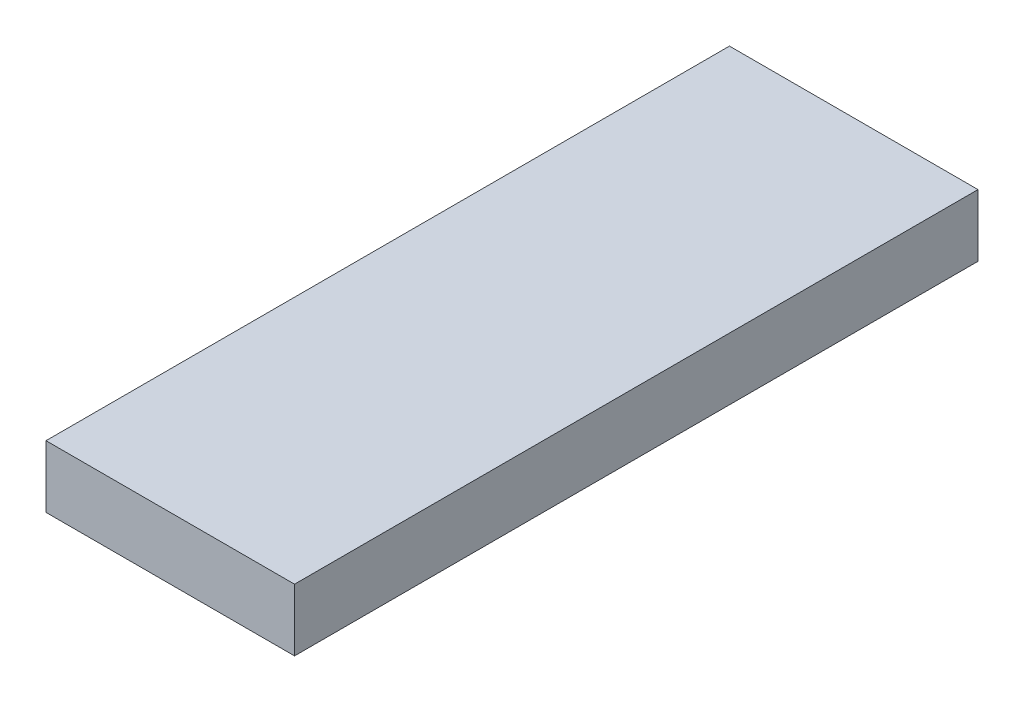
ISO-10303-21;
HEADER;
FILE_DESCRIPTION(('STEP AP214'),'2;1');
FILE_NAME('part.step','',(''),(''),'','','');
FILE_SCHEMA(('AUTOMOTIVE_DESIGN { 1 0 10303 214 1 1 1 1 }'));
ENDSEC;
DATA;
#1=APPLICATION_CONTEXT('core data for automotive mechanical design processes');
#2=APPLICATION_PROTOCOL_DEFINITION('international standard','automotive_design',2000,#1);
#3=PRODUCT_CONTEXT('',#1,'mechanical');
#4=PRODUCT('Part','Part','',(#3));
#5=PRODUCT_RELATED_PRODUCT_CATEGORY('part','',(#4));
#6=PRODUCT_DEFINITION_FORMATION('','',#4);
#7=PRODUCT_DEFINITION_CONTEXT('part definition',#1,'design');
#8=PRODUCT_DEFINITION('design','',#6,#7);
#9=PRODUCT_DEFINITION_SHAPE('','',#8);
#10=(LENGTH_UNIT() NAMED_UNIT(*) SI_UNIT(.MILLI.,.METRE.));
#11=(NAMED_UNIT(*) PLANE_ANGLE_UNIT() SI_UNIT($,.RADIAN.));
#12=(NAMED_UNIT(*) SI_UNIT($,.STERADIAN.) SOLID_ANGLE_UNIT());
#13=UNCERTAINTY_MEASURE_WITH_UNIT(LENGTH_MEASURE(1.E-05),#10,'distance_accuracy_value','');
#14=(GEOMETRIC_REPRESENTATION_CONTEXT(3) GLOBAL_UNCERTAINTY_ASSIGNED_CONTEXT((#13)) GLOBAL_UNIT_ASSIGNED_CONTEXT((#10,
#11,#12)) REPRESENTATION_CONTEXT('',''));
#15=CARTESIAN_POINT('',(0.,0.,0.));
#16=DIRECTION('',(0.,0.,1.));
#17=DIRECTION('',(1.,0.,0.));
#18=AXIS2_PLACEMENT_3D('',#15,#16,#17);
#19=CARTESIAN_POINT('',(20.,10.,-55.0000000000001));
#20=DIRECTION('',(-1.,0.,0.));
#21=DIRECTION('',(0.,0.,1.));
#22=AXIS2_PLACEMENT_3D('',#19,#20,#21);
#23=PLANE('',#22);
#24=DIRECTION('',(0.,0.,-1.));
#25=VECTOR('',#24,1.);
#26=CARTESIAN_POINT('',(20.,0.,-55.0000000000001));
#27=LINE('',#26,#25);
#28=CARTESIAN_POINT('',(20.0000000000001,0.,54.9999999999999));
#29=VERTEX_POINT('',#28);
#30=CARTESIAN_POINT('',(20.,0.,-55.0000000000001));
#31=VERTEX_POINT('',#30);
#32=EDGE_CURVE('E97',#29,#31,#27,.T.);
#33=ORIENTED_EDGE('',*,*,#32,.T.);
#34=DIRECTION('',(0.,-1.,0.));
#35=VECTOR('',#34,1.);
#36=CARTESIAN_POINT('',(20.,10.,-55.0000000000001));
#37=LINE('',#36,#35);
#38=CARTESIAN_POINT('',(20.,10.,-55.0000000000001));
#39=VERTEX_POINT('',#38);
#40=EDGE_CURVE('E11',#39,#31,#37,.T.);
#41=ORIENTED_EDGE('',*,*,#40,.F.);
#42=DIRECTION('',(0.,0.,-1.));
#43=VECTOR('',#42,1.);
#44=CARTESIAN_POINT('',(20.,10.,-55.0000000000001));
#45=LINE('',#44,#43);
#46=CARTESIAN_POINT('',(20.0000000000001,10.,54.9999999999999));
#47=VERTEX_POINT('',#46);
#48=EDGE_CURVE('E85',#47,#39,#45,.T.);
#49=ORIENTED_EDGE('',*,*,#48,.F.);
#50=DIRECTION('',(0.,-1.,0.));
#51=VECTOR('',#50,1.);
#52=CARTESIAN_POINT('',(20.0000000000001,10.,54.9999999999999));
#53=LINE('',#52,#51);
#54=EDGE_CURVE('E93',#47,#29,#53,.T.);
#55=ORIENTED_EDGE('',*,*,#54,.T.);
#56=EDGE_LOOP('',(#33,#41,#49,#55));
#57=FACE_BOUND('',#56,.T.);
#58=ADVANCED_FACE('F34',(#57),#23,.F.);
#59=CARTESIAN_POINT('',(-20.,10.,-55.0000000000001));
#60=DIRECTION('',(0.,0.,1.));
#61=DIRECTION('',(1.,0.,0.));
#62=AXIS2_PLACEMENT_3D('',#59,#60,#61);
#63=PLANE('',#62);
#64=DIRECTION('',(-1.,0.,0.));
#65=VECTOR('',#64,1.);
#66=CARTESIAN_POINT('',(-20.,0.,-55.0000000000001));
#67=LINE('',#66,#65);
#68=CARTESIAN_POINT('',(-20.,0.,-55.0000000000001));
#69=VERTEX_POINT('',#68);
#70=EDGE_CURVE('E89',#31,#69,#67,.T.);
#71=ORIENTED_EDGE('',*,*,#70,.T.);
#72=DIRECTION('',(0.,-1.,0.));
#73=VECTOR('',#72,1.);
#74=CARTESIAN_POINT('',(-20.,10.,-55.0000000000001));
#75=LINE('',#74,#73);
#76=CARTESIAN_POINT('',(-20.,10.,-55.0000000000001));
#77=VERTEX_POINT('',#76);
#78=EDGE_CURVE('E42',#77,#69,#75,.T.);
#79=ORIENTED_EDGE('',*,*,#78,.F.);
#80=DIRECTION('',(-1.,0.,0.));
#81=VECTOR('',#80,1.);
#82=CARTESIAN_POINT('',(-20.,10.,-55.0000000000001));
#83=LINE('',#82,#81);
#84=EDGE_CURVE('E80',#39,#77,#83,.T.);
#85=ORIENTED_EDGE('',*,*,#84,.F.);
#86=ORIENTED_EDGE('',*,*,#40,.T.);
#87=EDGE_LOOP('',(#71,#79,#85,#86));
#88=FACE_BOUND('',#87,.T.);
#89=ADVANCED_FACE('F88',(#88),#63,.F.);
#90=CARTESIAN_POINT('',(-20.,10.,-55.0000000000001));
#91=DIRECTION('',(1.,0.,0.));
#92=DIRECTION('',(0.,0.,-1.));
#93=AXIS2_PLACEMENT_3D('',#90,#91,#92);
#94=PLANE('',#93);
#95=DIRECTION('',(0.,0.,1.));
#96=VECTOR('',#95,1.);
#97=CARTESIAN_POINT('',(-20.,0.,-55.0000000000001));
#98=LINE('',#97,#96);
#99=CARTESIAN_POINT('',(-20.,0.,54.9999999999999));
#100=VERTEX_POINT('',#99);
#101=EDGE_CURVE('E67',#69,#100,#98,.T.);
#102=ORIENTED_EDGE('',*,*,#101,.T.);
#103=DIRECTION('',(0.,-1.,0.));
#104=VECTOR('',#103,1.);
#105=CARTESIAN_POINT('',(-20.,10.,54.9999999999999));
#106=LINE('',#105,#104);
#107=CARTESIAN_POINT('',(-20.,10.,54.9999999999999));
#108=VERTEX_POINT('',#107);
#109=EDGE_CURVE('E90',#108,#100,#106,.T.);
#110=ORIENTED_EDGE('',*,*,#109,.F.);
#111=DIRECTION('',(0.,0.,1.));
#112=VECTOR('',#111,1.);
#113=CARTESIAN_POINT('',(-20.,10.,-55.0000000000001));
#114=LINE('',#113,#112);
#115=EDGE_CURVE('E83',#77,#108,#114,.T.);
#116=ORIENTED_EDGE('',*,*,#115,.F.);
#117=ORIENTED_EDGE('',*,*,#78,.T.);
#118=EDGE_LOOP('',(#102,#110,#116,#117));
#119=FACE_BOUND('',#118,.T.);
#120=ADVANCED_FACE('F91',(#119),#94,.F.);
#121=CARTESIAN_POINT('',(-20.,10.,54.9999999999999));
#122=DIRECTION('',(0.,0.,-1.));
#123=DIRECTION('',(-1.,0.,0.));
#124=AXIS2_PLACEMENT_3D('',#121,#122,#123);
#125=PLANE('',#124);
#126=DIRECTION('',(1.,0.,0.));
#127=VECTOR('',#126,1.);
#128=CARTESIAN_POINT('',(-20.,0.,54.9999999999999));
#129=LINE('',#128,#127);
#130=EDGE_CURVE('E73',#100,#29,#129,.T.);
#131=ORIENTED_EDGE('',*,*,#130,.T.);
#132=ORIENTED_EDGE('',*,*,#54,.F.);
#133=DIRECTION('',(1.,0.,0.));
#134=VECTOR('',#133,1.);
#135=CARTESIAN_POINT('',(-20.,10.,54.9999999999999));
#136=LINE('',#135,#134);
#137=EDGE_CURVE('E50',#108,#47,#136,.T.);
#138=ORIENTED_EDGE('',*,*,#137,.F.);
#139=ORIENTED_EDGE('',*,*,#109,.T.);
#140=EDGE_LOOP('',(#131,#132,#138,#139));
#141=FACE_BOUND('',#140,.T.);
#142=ADVANCED_FACE('F104',(#141),#125,.F.);
#143=CARTESIAN_POINT('',(0.,10.,0.));
#144=DIRECTION('',(0.,1.,0.));
#145=DIRECTION('',(0.,0.,1.));
#146=AXIS2_PLACEMENT_3D('',#143,#144,#145);
#147=PLANE('',#146);
#148=ORIENTED_EDGE('',*,*,#48,.T.);
#149=ORIENTED_EDGE('',*,*,#84,.T.);
#150=ORIENTED_EDGE('',*,*,#115,.T.);
#151=ORIENTED_EDGE('',*,*,#137,.T.);
#152=EDGE_LOOP('',(#148,#149,#150,#151));
#153=FACE_BOUND('',#152,.T.);
#154=ADVANCED_FACE('F81',(#153),#147,.T.);
#155=CARTESIAN_POINT('',(0.,0.,0.));
#156=DIRECTION('',(0.,1.,0.));
#157=DIRECTION('',(0.,0.,1.));
#158=AXIS2_PLACEMENT_3D('',#155,#156,#157);
#159=PLANE('',#158);
#160=ORIENTED_EDGE('',*,*,#32,.F.);
#161=ORIENTED_EDGE('',*,*,#130,.F.);
#162=ORIENTED_EDGE('',*,*,#101,.F.);
#163=ORIENTED_EDGE('',*,*,#70,.F.);
#164=EDGE_LOOP('',(#160,#161,#162,#163));
#165=FACE_BOUND('',#164,.T.);
#166=ADVANCED_FACE('F107',(#165),#159,.F.);
#167=CLOSED_SHELL('',(#58,#89,#120,#142,#154,#166));
#168=MANIFOLD_SOLID_BREP('B2',#167);
#169=ADVANCED_BREP_SHAPE_REPRESENTATION('',(#18,#168),#14);
#170=SHAPE_DEFINITION_REPRESENTATION(#9,#169);
ENDSEC;
END-ISO-10303-21;
